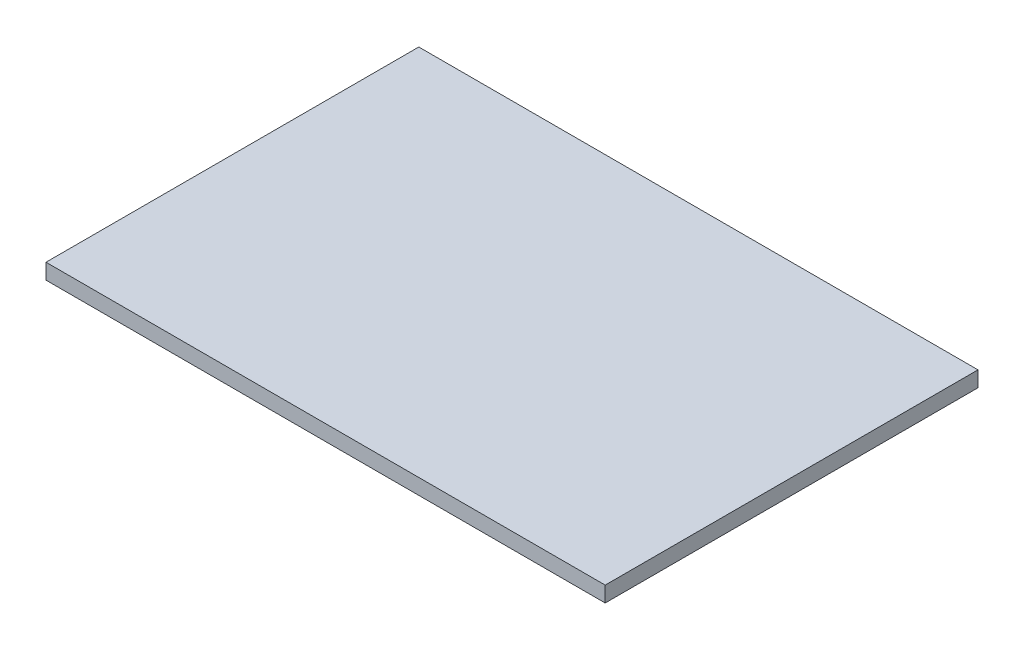
ISO-10303-21;
HEADER;
FILE_DESCRIPTION(('STEP AP214'),'2;1');
FILE_NAME('part.step','',(''),(''),'','','');
FILE_SCHEMA(('AUTOMOTIVE_DESIGN { 1 0 10303 214 1 1 1 1 }'));
ENDSEC;
DATA;
#1=APPLICATION_CONTEXT('core data for automotive mechanical design processes');
#2=APPLICATION_PROTOCOL_DEFINITION('international standard','automotive_design',2000,#1);
#3=PRODUCT_CONTEXT('',#1,'mechanical');
#4=PRODUCT('Part','Part','',(#3));
#5=PRODUCT_RELATED_PRODUCT_CATEGORY('part','',(#4));
#6=PRODUCT_DEFINITION_FORMATION('','',#4);
#7=PRODUCT_DEFINITION_CONTEXT('part definition',#1,'design');
#8=PRODUCT_DEFINITION('design','',#6,#7);
#9=PRODUCT_DEFINITION_SHAPE('','',#8);
#10=(LENGTH_UNIT() NAMED_UNIT(*) SI_UNIT(.MILLI.,.METRE.));
#11=(NAMED_UNIT(*) PLANE_ANGLE_UNIT() SI_UNIT($,.RADIAN.));
#12=(NAMED_UNIT(*) SI_UNIT($,.STERADIAN.) SOLID_ANGLE_UNIT());
#13=UNCERTAINTY_MEASURE_WITH_UNIT(LENGTH_MEASURE(1.E-05),#10,'distance_accuracy_value','');
#14=(GEOMETRIC_REPRESENTATION_CONTEXT(3) GLOBAL_UNCERTAINTY_ASSIGNED_CONTEXT((#13)) GLOBAL_UNIT_ASSIGNED_CONTEXT((#10,
#11,#12)) REPRESENTATION_CONTEXT('',''));
#15=CARTESIAN_POINT('',(0.,0.,0.));
#16=DIRECTION('',(0.,0.,1.));
#17=DIRECTION('',(1.,0.,0.));
#18=AXIS2_PLACEMENT_3D('',#15,#16,#17);
#19=CARTESIAN_POINT('',(0.,1.5875,0.));
#20=DIRECTION('',(1.,0.,0.));
#21=DIRECTION('',(0.,0.,-1.));
#22=AXIS2_PLACEMENT_3D('',#19,#20,#21);
#23=PLANE('',#22);
#24=DIRECTION('',(0.,0.,1.));
#25=VECTOR('',#24,1.);
#26=CARTESIAN_POINT('',(0.,0.,0.));
#27=LINE('',#26,#25);
#28=CARTESIAN_POINT('',(0.,0.,-38.1));
#29=VERTEX_POINT('',#28);
#30=CARTESIAN_POINT('',(0.,0.,0.));
#31=VERTEX_POINT('',#30);
#32=EDGE_CURVE('E96',#29,#31,#27,.T.);
#33=ORIENTED_EDGE('',*,*,#32,.T.);
#34=DIRECTION('',(0.,-1.,0.));
#35=VECTOR('',#34,1.);
#36=CARTESIAN_POINT('',(0.,1.5875,0.));
#37=LINE('',#36,#35);
#38=CARTESIAN_POINT('',(0.,1.5875,0.));
#39=VERTEX_POINT('',#38);
#40=EDGE_CURVE('E11',#39,#31,#37,.T.);
#41=ORIENTED_EDGE('',*,*,#40,.F.);
#42=DIRECTION('',(0.,0.,1.));
#43=VECTOR('',#42,1.);
#44=CARTESIAN_POINT('',(0.,1.5875,0.));
#45=LINE('',#44,#43);
#46=CARTESIAN_POINT('',(0.,1.5875,-38.1));
#47=VERTEX_POINT('',#46);
#48=EDGE_CURVE('E84',#47,#39,#45,.T.);
#49=ORIENTED_EDGE('',*,*,#48,.F.);
#50=DIRECTION('',(0.,-1.,0.));
#51=VECTOR('',#50,1.);
#52=CARTESIAN_POINT('',(0.,1.5875,-38.1));
#53=LINE('',#52,#51);
#54=EDGE_CURVE('E92',#47,#29,#53,.T.);
#55=ORIENTED_EDGE('',*,*,#54,.T.);
#56=EDGE_LOOP('',(#33,#41,#49,#55));
#57=FACE_BOUND('',#56,.T.);
#58=ADVANCED_FACE('F33',(#57),#23,.F.);
#59=CARTESIAN_POINT('',(0.,1.5875,0.));
#60=DIRECTION('',(0.,0.,-1.));
#61=DIRECTION('',(-1.,0.,0.));
#62=AXIS2_PLACEMENT_3D('',#59,#60,#61);
#63=PLANE('',#62);
#64=DIRECTION('',(1.,0.,0.));
#65=VECTOR('',#64,1.);
#66=CARTESIAN_POINT('',(0.,0.,0.));
#67=LINE('',#66,#65);
#68=CARTESIAN_POINT('',(57.15,0.,0.));
#69=VERTEX_POINT('',#68);
#70=EDGE_CURVE('E88',#31,#69,#67,.T.);
#71=ORIENTED_EDGE('',*,*,#70,.T.);
#72=DIRECTION('',(0.,-1.,0.));
#73=VECTOR('',#72,1.);
#74=CARTESIAN_POINT('',(57.15,1.5875,0.));
#75=LINE('',#74,#73);
#76=CARTESIAN_POINT('',(57.15,1.5875,0.));
#77=VERTEX_POINT('',#76);
#78=EDGE_CURVE('E41',#77,#69,#75,.T.);
#79=ORIENTED_EDGE('',*,*,#78,.F.);
#80=DIRECTION('',(1.,0.,0.));
#81=VECTOR('',#80,1.);
#82=CARTESIAN_POINT('',(0.,1.5875,0.));
#83=LINE('',#82,#81);
#84=EDGE_CURVE('E79',#39,#77,#83,.T.);
#85=ORIENTED_EDGE('',*,*,#84,.F.);
#86=ORIENTED_EDGE('',*,*,#40,.T.);
#87=EDGE_LOOP('',(#71,#79,#85,#86));
#88=FACE_BOUND('',#87,.T.);
#89=ADVANCED_FACE('F87',(#88),#63,.F.);
#90=CARTESIAN_POINT('',(57.15,1.5875,0.));
#91=DIRECTION('',(-1.,0.,0.));
#92=DIRECTION('',(0.,0.,1.));
#93=AXIS2_PLACEMENT_3D('',#90,#91,#92);
#94=PLANE('',#93);
#95=DIRECTION('',(0.,0.,-1.));
#96=VECTOR('',#95,1.);
#97=CARTESIAN_POINT('',(57.15,0.,0.));
#98=LINE('',#97,#96);
#99=CARTESIAN_POINT('',(57.15,0.,-38.1));
#100=VERTEX_POINT('',#99);
#101=EDGE_CURVE('E66',#69,#100,#98,.T.);
#102=ORIENTED_EDGE('',*,*,#101,.T.);
#103=DIRECTION('',(0.,-1.,0.));
#104=VECTOR('',#103,1.);
#105=CARTESIAN_POINT('',(57.15,1.5875,-38.1));
#106=LINE('',#105,#104);
#107=CARTESIAN_POINT('',(57.15,1.5875,-38.1));
#108=VERTEX_POINT('',#107);
#109=EDGE_CURVE('E89',#108,#100,#106,.T.);
#110=ORIENTED_EDGE('',*,*,#109,.F.);
#111=DIRECTION('',(0.,0.,-1.));
#112=VECTOR('',#111,1.);
#113=CARTESIAN_POINT('',(57.15,1.5875,0.));
#114=LINE('',#113,#112);
#115=EDGE_CURVE('E82',#77,#108,#114,.T.);
#116=ORIENTED_EDGE('',*,*,#115,.F.);
#117=ORIENTED_EDGE('',*,*,#78,.T.);
#118=EDGE_LOOP('',(#102,#110,#116,#117));
#119=FACE_BOUND('',#118,.T.);
#120=ADVANCED_FACE('F90',(#119),#94,.F.);
#121=CARTESIAN_POINT('',(0.,1.5875,-38.1));
#122=DIRECTION('',(0.,0.,1.));
#123=DIRECTION('',(1.,0.,0.));
#124=AXIS2_PLACEMENT_3D('',#121,#122,#123);
#125=PLANE('',#124);
#126=DIRECTION('',(-1.,0.,0.));
#127=VECTOR('',#126,1.);
#128=CARTESIAN_POINT('',(0.,0.,-38.1));
#129=LINE('',#128,#127);
#130=EDGE_CURVE('E72',#100,#29,#129,.T.);
#131=ORIENTED_EDGE('',*,*,#130,.T.);
#132=ORIENTED_EDGE('',*,*,#54,.F.);
#133=DIRECTION('',(-1.,0.,0.));
#134=VECTOR('',#133,1.);
#135=CARTESIAN_POINT('',(0.,1.5875,-38.1));
#136=LINE('',#135,#134);
#137=EDGE_CURVE('E49',#108,#47,#136,.T.);
#138=ORIENTED_EDGE('',*,*,#137,.F.);
#139=ORIENTED_EDGE('',*,*,#109,.T.);
#140=EDGE_LOOP('',(#131,#132,#138,#139));
#141=FACE_BOUND('',#140,.T.);
#142=ADVANCED_FACE('F103',(#141),#125,.F.);
#143=CARTESIAN_POINT('',(0.,1.5875,0.));
#144=DIRECTION('',(0.,-1.,0.));
#145=DIRECTION('',(0.,0.,-1.));
#146=AXIS2_PLACEMENT_3D('',#143,#144,#145);
#147=PLANE('',#146);
#148=ORIENTED_EDGE('',*,*,#48,.T.);
#149=ORIENTED_EDGE('',*,*,#84,.T.);
#150=ORIENTED_EDGE('',*,*,#115,.T.);
#151=ORIENTED_EDGE('',*,*,#137,.T.);
#152=EDGE_LOOP('',(#148,#149,#150,#151));
#153=FACE_BOUND('',#152,.T.);
#154=ADVANCED_FACE('F80',(#153),#147,.F.);
#155=CARTESIAN_POINT('',(0.,0.,0.));
#156=DIRECTION('',(0.,-1.,0.));
#157=DIRECTION('',(0.,0.,-1.));
#158=AXIS2_PLACEMENT_3D('',#155,#156,#157);
#159=PLANE('',#158);
#160=ORIENTED_EDGE('',*,*,#32,.F.);
#161=ORIENTED_EDGE('',*,*,#130,.F.);
#162=ORIENTED_EDGE('',*,*,#101,.F.);
#163=ORIENTED_EDGE('',*,*,#70,.F.);
#164=EDGE_LOOP('',(#160,#161,#162,#163));
#165=FACE_BOUND('',#164,.T.);
#166=ADVANCED_FACE('F106',(#165),#159,.T.);
#167=CLOSED_SHELL('',(#58,#89,#120,#142,#154,#166));
#168=MANIFOLD_SOLID_BREP('B2',#167);
#169=ADVANCED_BREP_SHAPE_REPRESENTATION('',(#18,#168),#14);
#170=SHAPE_DEFINITION_REPRESENTATION(#9,#169);
ENDSEC;
END-ISO-10303-21;
